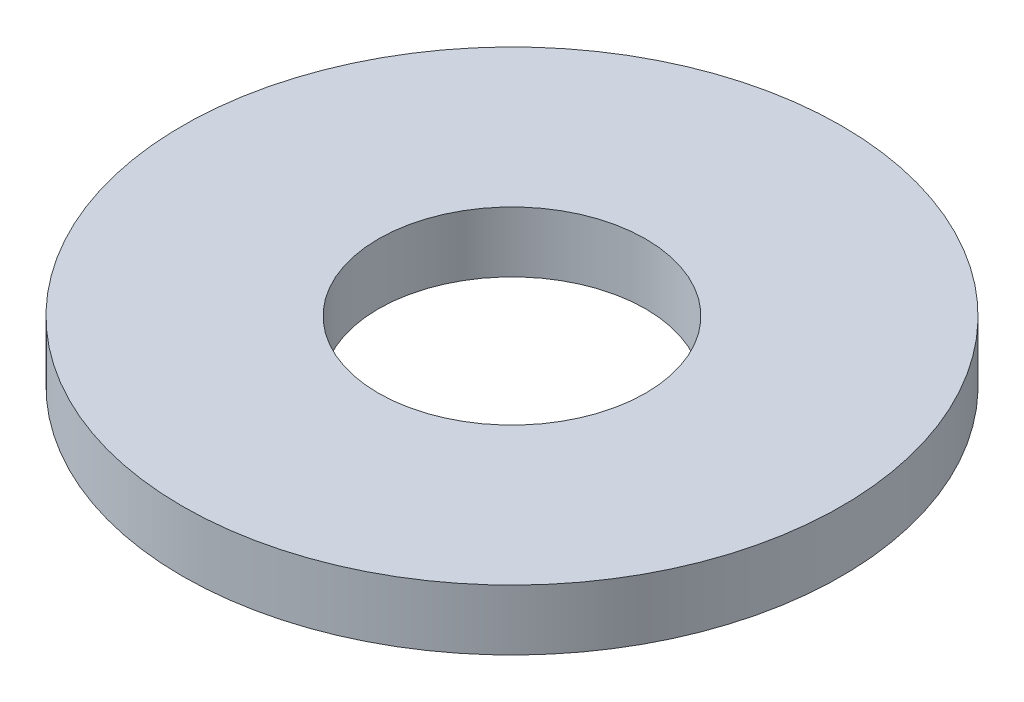
ISO-10303-21;
HEADER;
FILE_DESCRIPTION(('STEP AP214'),'2;1');
FILE_NAME('part.step','',(''),(''),'','','');
FILE_SCHEMA(('AUTOMOTIVE_DESIGN { 1 0 10303 214 1 1 1 1 }'));
ENDSEC;
DATA;
#1=APPLICATION_CONTEXT('core data for automotive mechanical design processes');
#2=APPLICATION_PROTOCOL_DEFINITION('international standard','automotive_design',2000,#1);
#3=PRODUCT_CONTEXT('',#1,'mechanical');
#4=PRODUCT('Part','Part','',(#3));
#5=PRODUCT_RELATED_PRODUCT_CATEGORY('part','',(#4));
#6=PRODUCT_DEFINITION_FORMATION('','',#4);
#7=PRODUCT_DEFINITION_CONTEXT('part definition',#1,'design');
#8=PRODUCT_DEFINITION('design','',#6,#7);
#9=PRODUCT_DEFINITION_SHAPE('','',#8);
#10=(LENGTH_UNIT() NAMED_UNIT(*) SI_UNIT(.MILLI.,.METRE.));
#11=(NAMED_UNIT(*) PLANE_ANGLE_UNIT() SI_UNIT($,.RADIAN.));
#12=(NAMED_UNIT(*) SI_UNIT($,.STERADIAN.) SOLID_ANGLE_UNIT());
#13=UNCERTAINTY_MEASURE_WITH_UNIT(LENGTH_MEASURE(1.E-05),#10,'distance_accuracy_value','');
#14=(GEOMETRIC_REPRESENTATION_CONTEXT(3) GLOBAL_UNCERTAINTY_ASSIGNED_CONTEXT((#13)) GLOBAL_UNIT_ASSIGNED_CONTEXT((#10,
#11,#12)) REPRESENTATION_CONTEXT('',''));
#15=CARTESIAN_POINT('',(0.,0.,0.));
#16=DIRECTION('',(0.,0.,1.));
#17=DIRECTION('',(1.,0.,0.));
#18=AXIS2_PLACEMENT_3D('',#15,#16,#17);
#19=CARTESIAN_POINT('',(0.,17.,0.));
#20=DIRECTION('',(0.,-1.,0.));
#21=DIRECTION('',(0.,0.,-1.));
#22=AXIS2_PLACEMENT_3D('',#19,#20,#21);
#23=CYLINDRICAL_SURFACE('',#22,92.5);
#24=CARTESIAN_POINT('',(0.,17.,0.));
#25=DIRECTION('',(0.,1.,0.));
#26=DIRECTION('',(0.,0.,1.));
#27=AXIS2_PLACEMENT_3D('',#24,#25,#26);
#28=CIRCLE('',#27,92.5);
#29=CARTESIAN_POINT('',(0.,17.,92.5));
#30=VERTEX_POINT('',#29);
#31=EDGE_CURVE('E10',#30,#30,#28,.T.);
#32=ORIENTED_EDGE('',*,*,#31,.F.);
#33=EDGE_LOOP('',(#32));
#34=FACE_BOUND('',#33,.T.);
#35=CARTESIAN_POINT('',(0.,0.,0.));
#36=DIRECTION('',(0.,1.,0.));
#37=DIRECTION('',(0.,0.,1.));
#38=AXIS2_PLACEMENT_3D('',#35,#36,#37);
#39=CIRCLE('',#38,92.5);
#40=CARTESIAN_POINT('',(0.,0.,92.5));
#41=VERTEX_POINT('',#40);
#42=EDGE_CURVE('E37',#41,#41,#39,.T.);
#43=ORIENTED_EDGE('',*,*,#42,.T.);
#44=EDGE_LOOP('',(#43));
#45=FACE_BOUND('',#44,.T.);
#46=ADVANCED_FACE('F40',(#34,#45),#23,.T.);
#47=CARTESIAN_POINT('',(0.,17.,0.));
#48=DIRECTION('',(0.,1.,0.));
#49=DIRECTION('',(0.,0.,1.));
#50=AXIS2_PLACEMENT_3D('',#47,#48,#49);
#51=PLANE('',#50);
#52=CARTESIAN_POINT('',(0.,17.,0.));
#53=DIRECTION('',(0.,1.,0.));
#54=DIRECTION('',(0.,0.,1.));
#55=AXIS2_PLACEMENT_3D('',#52,#53,#54);
#56=CIRCLE('',#55,37.5);
#57=CARTESIAN_POINT('',(0.,17.,37.5));
#58=VERTEX_POINT('',#57);
#59=EDGE_CURVE('E50',#58,#58,#56,.T.);
#60=ORIENTED_EDGE('',*,*,#59,.F.);
#61=EDGE_LOOP('',(#60));
#62=FACE_BOUND('',#61,.T.);
#63=ORIENTED_EDGE('',*,*,#31,.T.);
#64=EDGE_LOOP('',(#63));
#65=FACE_BOUND('',#64,.T.);
#66=ADVANCED_FACE('F59',(#62,#65),#51,.T.);
#67=CARTESIAN_POINT('',(0.,0.,0.));
#68=DIRECTION('',(0.,1.,0.));
#69=DIRECTION('',(0.,0.,1.));
#70=AXIS2_PLACEMENT_3D('',#67,#68,#69);
#71=PLANE('',#70);
#72=CARTESIAN_POINT('',(0.,0.,0.));
#73=DIRECTION('',(0.,1.,0.));
#74=DIRECTION('',(0.,0.,1.));
#75=AXIS2_PLACEMENT_3D('',#72,#73,#74);
#76=CIRCLE('',#75,37.5);
#77=CARTESIAN_POINT('',(0.,0.,37.5));
#78=VERTEX_POINT('',#77);
#79=EDGE_CURVE('E47',#78,#78,#76,.T.);
#80=ORIENTED_EDGE('',*,*,#79,.T.);
#81=EDGE_LOOP('',(#80));
#82=FACE_BOUND('',#81,.T.);
#83=ORIENTED_EDGE('',*,*,#42,.F.);
#84=EDGE_LOOP('',(#83));
#85=FACE_BOUND('',#84,.T.);
#86=ADVANCED_FACE('F58',(#82,#85),#71,.F.);
#87=CARTESIAN_POINT('',(0.,17.,0.));
#88=DIRECTION('',(0.,-1.,0.));
#89=DIRECTION('',(0.,0.,-1.));
#90=AXIS2_PLACEMENT_3D('',#87,#88,#89);
#91=CYLINDRICAL_SURFACE('',#90,37.5);
#92=ORIENTED_EDGE('',*,*,#59,.T.);
#93=EDGE_LOOP('',(#92));
#94=FACE_BOUND('',#93,.T.);
#95=ORIENTED_EDGE('',*,*,#79,.F.);
#96=EDGE_LOOP('',(#95));
#97=FACE_BOUND('',#96,.T.);
#98=ADVANCED_FACE('F54',(#94,#97),#91,.F.);
#99=CLOSED_SHELL('',(#46,#66,#86,#98));
#100=MANIFOLD_SOLID_BREP('B2',#99);
#101=ADVANCED_BREP_SHAPE_REPRESENTATION('',(#18,#100),#14);
#102=SHAPE_DEFINITION_REPRESENTATION(#9,#101);
ENDSEC;
END-ISO-10303-21;
